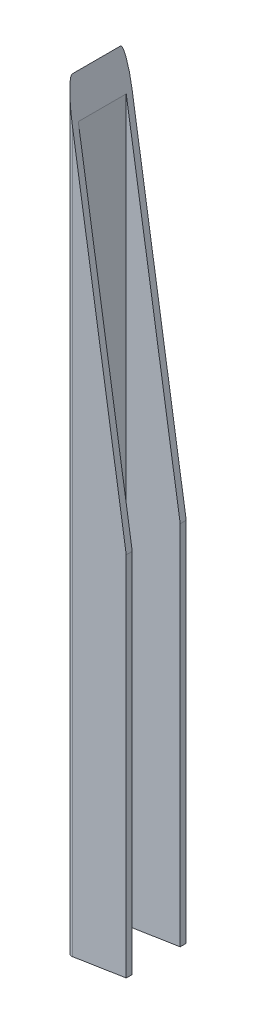
ISO-10303-21;
HEADER;
FILE_DESCRIPTION(('STEP AP214'),'2;1');
FILE_NAME('part.step','',(''),(''),'','','');
FILE_SCHEMA(('AUTOMOTIVE_DESIGN { 1 0 10303 214 1 1 1 1 }'));
ENDSEC;
DATA;
#1=APPLICATION_CONTEXT('core data for automotive mechanical design processes');
#2=APPLICATION_PROTOCOL_DEFINITION('international standard','automotive_design',2000,#1);
#3=PRODUCT_CONTEXT('',#1,'mechanical');
#4=PRODUCT('Part','Part','',(#3));
#5=PRODUCT_RELATED_PRODUCT_CATEGORY('part','',(#4));
#6=PRODUCT_DEFINITION_FORMATION('','',#4);
#7=PRODUCT_DEFINITION_CONTEXT('part definition',#1,'design');
#8=PRODUCT_DEFINITION('design','',#6,#7);
#9=PRODUCT_DEFINITION_SHAPE('','',#8);
#10=(LENGTH_UNIT() NAMED_UNIT(*) SI_UNIT(.MILLI.,.METRE.));
#11=(NAMED_UNIT(*) PLANE_ANGLE_UNIT() SI_UNIT($,.RADIAN.));
#12=(NAMED_UNIT(*) SI_UNIT($,.STERADIAN.) SOLID_ANGLE_UNIT());
#13=UNCERTAINTY_MEASURE_WITH_UNIT(LENGTH_MEASURE(1.E-05),#10,'distance_accuracy_value','');
#14=(GEOMETRIC_REPRESENTATION_CONTEXT(3) GLOBAL_UNCERTAINTY_ASSIGNED_CONTEXT((#13)) GLOBAL_UNIT_ASSIGNED_CONTEXT((#10,
#11,#12)) REPRESENTATION_CONTEXT('',''));
#15=CARTESIAN_POINT('',(0.,0.,0.));
#16=DIRECTION('',(0.,0.,1.));
#17=DIRECTION('',(1.,0.,0.));
#18=AXIS2_PLACEMENT_3D('',#15,#16,#17);
#19=CARTESIAN_POINT('',(-37.,380.,-12.));
#20=DIRECTION('',(0.,-1.,0.));
#21=DIRECTION('',(0.,0.,-1.));
#22=AXIS2_PLACEMENT_3D('',#19,#20,#21);
#23=CYLINDRICAL_SURFACE('',#22,3.);
#24=CARTESIAN_POINT('',(-37.,360.807534592797,-12.));
#25=DIRECTION('',(0.988002788154989,0.154436040476205,0.));
#26=DIRECTION('',(0.154436040476205,-0.988002788154989,0.));
#27=AXIS2_PLACEMENT_3D('',#24,#25,#26);
#28=ELLIPSE('',#27,19.4255174553133,3.);
#29=CARTESIAN_POINT('',(-37.,360.807534592797,-15.));
#30=VERTEX_POINT('',#29);
#31=CARTESIAN_POINT('',(-40.,380.,-12.));
#32=VERTEX_POINT('',#31);
#33=EDGE_CURVE('E179',#30,#32,#28,.T.);
#34=ORIENTED_EDGE('',*,*,#33,.F.);
#35=DIRECTION('',(0.,-1.,0.));
#36=VECTOR('',#35,1.);
#37=CARTESIAN_POINT('',(-37.,380.,-15.));
#38=LINE('',#37,#36);
#39=CARTESIAN_POINT('',(-37.,0.468934022234703,-15.));
#40=VERTEX_POINT('',#39);
#41=EDGE_CURVE('E167',#30,#40,#38,.T.);
#42=ORIENTED_EDGE('',*,*,#41,.T.);
#43=CARTESIAN_POINT('',(-37.,0.46893402223469,-12.));
#44=DIRECTION('',(0.154436040476207,-0.988002788154989,0.));
#45=DIRECTION('',(-0.988002788154989,-0.154436040476207,0.));
#46=AXIS2_PLACEMENT_3D('',#43,#44,#45);
#47=ELLIPSE('',#46,3.03642867810347,3.);
#48=CARTESIAN_POINT('',(-40.,0.,-12.));
#49=VERTEX_POINT('',#48);
#50=EDGE_CURVE('E236',#49,#40,#47,.T.);
#51=ORIENTED_EDGE('',*,*,#50,.F.);
#52=DIRECTION('',(0.,-1.,0.));
#53=VECTOR('',#52,1.);
#54=CARTESIAN_POINT('',(-40.,380.,-12.));
#55=LINE('',#54,#53);
#56=EDGE_CURVE('E200',#32,#49,#55,.T.);
#57=ORIENTED_EDGE('',*,*,#56,.F.);
#58=EDGE_LOOP('',(#34,#42,#51,#57));
#59=FACE_BOUND('',#58,.T.);
#60=ADVANCED_FACE('F73',(#59),#23,.T.);
#61=CARTESIAN_POINT('',(-37.,380.,12.));
#62=DIRECTION('',(0.,-1.,0.));
#63=DIRECTION('',(0.,0.,-1.));
#64=AXIS2_PLACEMENT_3D('',#61,#62,#63);
#65=CYLINDRICAL_SURFACE('',#64,3.);
#66=CARTESIAN_POINT('',(-37.,360.807534592797,12.));
#67=DIRECTION('',(0.988002788154989,0.154436040476205,0.));
#68=DIRECTION('',(0.154436040476205,-0.988002788154989,0.));
#69=AXIS2_PLACEMENT_3D('',#66,#67,#68);
#70=ELLIPSE('',#69,19.4255174553134,3.);
#71=CARTESIAN_POINT('',(-40.,380.,12.));
#72=VERTEX_POINT('',#71);
#73=CARTESIAN_POINT('',(-37.,360.807534592797,15.));
#74=VERTEX_POINT('',#73);
#75=EDGE_CURVE('E222',#72,#74,#70,.T.);
#76=ORIENTED_EDGE('',*,*,#75,.F.);
#77=DIRECTION('',(0.,-1.,0.));
#78=VECTOR('',#77,1.);
#79=CARTESIAN_POINT('',(-40.,380.,12.));
#80=LINE('',#79,#78);
#81=CARTESIAN_POINT('',(-40.,0.,12.));
#82=VERTEX_POINT('',#81);
#83=EDGE_CURVE('E197',#72,#82,#80,.T.);
#84=ORIENTED_EDGE('',*,*,#83,.T.);
#85=CARTESIAN_POINT('',(-37.,0.46893402223469,12.));
#86=DIRECTION('',(0.154436040476207,-0.988002788154989,0.));
#87=DIRECTION('',(-0.988002788154989,-0.154436040476207,0.));
#88=AXIS2_PLACEMENT_3D('',#85,#86,#87);
#89=ELLIPSE('',#88,3.03642867810348,3.);
#90=CARTESIAN_POINT('',(-37.,0.468934022234703,15.));
#91=VERTEX_POINT('',#90);
#92=EDGE_CURVE('E237',#91,#82,#89,.T.);
#93=ORIENTED_EDGE('',*,*,#92,.F.);
#94=DIRECTION('',(0.,-1.,0.));
#95=VECTOR('',#94,1.);
#96=CARTESIAN_POINT('',(-37.,380.,15.));
#97=LINE('',#96,#95);
#98=EDGE_CURVE('E194',#74,#91,#97,.T.);
#99=ORIENTED_EDGE('',*,*,#98,.F.);
#100=EDGE_LOOP('',(#76,#84,#93,#99));
#101=FACE_BOUND('',#100,.T.);
#102=ADVANCED_FACE('F263',(#101),#65,.T.);
#103=CARTESIAN_POINT('',(-37.,380.,15.));
#104=DIRECTION('',(0.,0.,-1.));
#105=DIRECTION('',(-1.,0.,0.));
#106=AXIS2_PLACEMENT_3D('',#103,#104,#105);
#107=PLANE('',#106);
#108=DIRECTION('',(-0.154436040476205,0.988002788154989,0.));
#109=VECTOR('',#108,1.);
#110=CARTESIAN_POINT('',(-40.,380.,15.));
#111=LINE('',#110,#109);
#112=CARTESIAN_POINT('',(-10.,188.07534592797,15.));
#113=VERTEX_POINT('',#112);
#114=EDGE_CURVE('E86',#113,#74,#111,.T.);
#115=ORIENTED_EDGE('',*,*,#114,.T.);
#116=ORIENTED_EDGE('',*,*,#98,.T.);
#117=DIRECTION('',(0.988002788154989,0.154436040476207,0.));
#118=VECTOR('',#117,1.);
#119=CARTESIAN_POINT('',(-10.,4.68934022234704,15.));
#120=LINE('',#119,#118);
#121=CARTESIAN_POINT('',(-10.,4.68934022234704,15.));
#122=VERTEX_POINT('',#121);
#123=EDGE_CURVE('E206',#91,#122,#120,.T.);
#124=ORIENTED_EDGE('',*,*,#123,.T.);
#125=DIRECTION('',(0.,1.,0.));
#126=VECTOR('',#125,1.);
#127=CARTESIAN_POINT('',(-10.,380.,15.));
#128=LINE('',#127,#126);
#129=EDGE_CURVE('E172',#122,#113,#128,.T.);
#130=ORIENTED_EDGE('',*,*,#129,.T.);
#131=EDGE_LOOP('',(#115,#116,#124,#130));
#132=FACE_BOUND('',#131,.T.);
#133=ADVANCED_FACE('F212',(#132),#107,.F.);
#134=CARTESIAN_POINT('',(-37.,380.,-15.));
#135=DIRECTION('',(0.,0.,1.));
#136=DIRECTION('',(1.,0.,0.));
#137=AXIS2_PLACEMENT_3D('',#134,#135,#136);
#138=PLANE('',#137);
#139=DIRECTION('',(-0.154436040476205,0.988002788154989,0.));
#140=VECTOR('',#139,1.);
#141=CARTESIAN_POINT('',(-40.,380.,-15.));
#142=LINE('',#141,#140);
#143=CARTESIAN_POINT('',(-10.,188.07534592797,-15.));
#144=VERTEX_POINT('',#143);
#145=EDGE_CURVE('E149',#144,#30,#142,.T.);
#146=ORIENTED_EDGE('',*,*,#145,.F.);
#147=DIRECTION('',(0.,-1.,0.));
#148=VECTOR('',#147,1.);
#149=CARTESIAN_POINT('',(-10.,380.,-15.));
#150=LINE('',#149,#148);
#151=CARTESIAN_POINT('',(-10.,4.68934022234706,-15.));
#152=VERTEX_POINT('',#151);
#153=EDGE_CURVE('E165',#144,#152,#150,.T.);
#154=ORIENTED_EDGE('',*,*,#153,.T.);
#155=DIRECTION('',(0.988002788154989,0.154436040476207,0.));
#156=VECTOR('',#155,1.);
#157=CARTESIAN_POINT('',(-10.,4.68934022234704,-15.));
#158=LINE('',#157,#156);
#159=EDGE_CURVE('E168',#40,#152,#158,.T.);
#160=ORIENTED_EDGE('',*,*,#159,.F.);
#161=ORIENTED_EDGE('',*,*,#41,.F.);
#162=EDGE_LOOP('',(#146,#154,#160,#161));
#163=FACE_BOUND('',#162,.T.);
#164=ADVANCED_FACE('F163',(#163),#138,.F.);
#165=CARTESIAN_POINT('',(-37.,380.,-12.));
#166=DIRECTION('',(1.,0.,0.));
#167=DIRECTION('',(0.,0.,-1.));
#168=AXIS2_PLACEMENT_3D('',#165,#166,#167);
#169=PLANE('',#168);
#170=DIRECTION('',(0.,-1.,0.));
#171=VECTOR('',#170,1.);
#172=CARTESIAN_POINT('',(-37.,380.,-12.));
#173=LINE('',#172,#171);
#174=CARTESIAN_POINT('',(-37.,360.807534592797,-12.));
#175=VERTEX_POINT('',#174);
#176=CARTESIAN_POINT('',(-37.,0.468934022234684,-12.));
#177=VERTEX_POINT('',#176);
#178=EDGE_CURVE('E176',#175,#177,#173,.T.);
#179=ORIENTED_EDGE('',*,*,#178,.F.);
#180=DIRECTION('',(0.,0.,1.));
#181=VECTOR('',#180,1.);
#182=CARTESIAN_POINT('',(-37.,360.807534592797,-12.));
#183=LINE('',#182,#181);
#184=CARTESIAN_POINT('',(-37.,360.807534592797,12.));
#185=VERTEX_POINT('',#184);
#186=EDGE_CURVE('E223',#175,#185,#183,.T.);
#187=ORIENTED_EDGE('',*,*,#186,.T.);
#188=DIRECTION('',(0.,-1.,0.));
#189=VECTOR('',#188,1.);
#190=CARTESIAN_POINT('',(-37.,380.,12.));
#191=LINE('',#190,#189);
#192=CARTESIAN_POINT('',(-37.,0.468934022234689,12.));
#193=VERTEX_POINT('',#192);
#194=EDGE_CURVE('E185',#185,#193,#191,.T.);
#195=ORIENTED_EDGE('',*,*,#194,.T.);
#196=DIRECTION('',(0.,0.,-1.));
#197=VECTOR('',#196,1.);
#198=CARTESIAN_POINT('',(-37.,0.46893402223469,-12.));
#199=LINE('',#198,#197);
#200=EDGE_CURVE('E242',#193,#177,#199,.T.);
#201=ORIENTED_EDGE('',*,*,#200,.T.);
#202=EDGE_LOOP('',(#179,#187,#195,#201));
#203=FACE_BOUND('',#202,.T.);
#204=ADVANCED_FACE('F253',(#203),#169,.T.);
#205=CARTESIAN_POINT('',(-37.,380.,12.));
#206=DIRECTION('',(0.,0.,-1.));
#207=DIRECTION('',(-1.,0.,0.));
#208=AXIS2_PLACEMENT_3D('',#205,#206,#207);
#209=PLANE('',#208);
#210=ORIENTED_EDGE('',*,*,#194,.F.);
#211=DIRECTION('',(0.154436040476205,-0.988002788154989,0.));
#212=VECTOR('',#211,1.);
#213=CARTESIAN_POINT('',(-39.9284485282061,379.542250284254,12.));
#214=LINE('',#213,#212);
#215=CARTESIAN_POINT('',(-10.,188.07534592797,12.));
#216=VERTEX_POINT('',#215);
#217=EDGE_CURVE('E217',#185,#216,#214,.T.);
#218=ORIENTED_EDGE('',*,*,#217,.T.);
#219=DIRECTION('',(0.,1.,0.));
#220=VECTOR('',#219,1.);
#221=CARTESIAN_POINT('',(-10.,380.,12.));
#222=LINE('',#221,#220);
#223=CARTESIAN_POINT('',(-10.,4.68934022234702,12.));
#224=VERTEX_POINT('',#223);
#225=EDGE_CURVE('E173',#224,#216,#222,.T.);
#226=ORIENTED_EDGE('',*,*,#225,.F.);
#227=DIRECTION('',(-0.988002788154989,-0.154436040476207,0.));
#228=VECTOR('',#227,1.);
#229=CARTESIAN_POINT('',(20.9100791894076,9.52093614297439,12.));
#230=LINE('',#229,#228);
#231=EDGE_CURVE('E94',#224,#193,#230,.T.);
#232=ORIENTED_EDGE('',*,*,#231,.T.);
#233=EDGE_LOOP('',(#210,#218,#226,#232));
#234=FACE_BOUND('',#233,.T.);
#235=ADVANCED_FACE('F221',(#234),#209,.T.);
#236=CARTESIAN_POINT('',(-37.,380.,-12.));
#237=DIRECTION('',(0.,0.,1.));
#238=DIRECTION('',(1.,0.,0.));
#239=AXIS2_PLACEMENT_3D('',#236,#237,#238);
#240=PLANE('',#239);
#241=DIRECTION('',(0.,-1.,0.));
#242=VECTOR('',#241,1.);
#243=CARTESIAN_POINT('',(-10.,380.,-12.));
#244=LINE('',#243,#242);
#245=CARTESIAN_POINT('',(-10.,188.07534592797,-12.));
#246=VERTEX_POINT('',#245);
#247=CARTESIAN_POINT('',(-10.,4.68934022234704,-12.));
#248=VERTEX_POINT('',#247);
#249=EDGE_CURVE('E203',#246,#248,#244,.T.);
#250=ORIENTED_EDGE('',*,*,#249,.F.);
#251=DIRECTION('',(-0.154436040476205,0.988002788154989,0.));
#252=VECTOR('',#251,1.);
#253=CARTESIAN_POINT('',(-39.9284485282061,379.542250284254,-12.));
#254=LINE('',#253,#252);
#255=EDGE_CURVE('E152',#246,#175,#254,.T.);
#256=ORIENTED_EDGE('',*,*,#255,.T.);
#257=ORIENTED_EDGE('',*,*,#178,.T.);
#258=DIRECTION('',(0.988002788154989,0.154436040476207,0.));
#259=VECTOR('',#258,1.);
#260=CARTESIAN_POINT('',(20.9100791894076,9.52093614297439,-12.));
#261=LINE('',#260,#259);
#262=EDGE_CURVE('E157',#177,#248,#261,.T.);
#263=ORIENTED_EDGE('',*,*,#262,.T.);
#264=EDGE_LOOP('',(#250,#256,#257,#263));
#265=FACE_BOUND('',#264,.T.);
#266=ADVANCED_FACE('F250',(#265),#240,.T.);
#267=CARTESIAN_POINT('',(-10.,0.,21.925100868927));
#268=DIRECTION('',(-1.,0.,0.));
#269=DIRECTION('',(0.,0.,1.));
#270=AXIS2_PLACEMENT_3D('',#267,#268,#269);
#271=PLANE('',#270);
#272=DIRECTION('',(0.,0.,1.));
#273=VECTOR('',#272,1.);
#274=CARTESIAN_POINT('',(-10.,188.07534592797,-15.));
#275=LINE('',#274,#273);
#276=EDGE_CURVE('E146',#144,#246,#275,.T.);
#277=ORIENTED_EDGE('',*,*,#276,.T.);
#278=ORIENTED_EDGE('',*,*,#249,.T.);
#279=DIRECTION('',(0.,0.,1.));
#280=VECTOR('',#279,1.);
#281=CARTESIAN_POINT('',(-10.,4.68934022234704,-15.));
#282=LINE('',#281,#280);
#283=EDGE_CURVE('E158',#152,#248,#282,.T.);
#284=ORIENTED_EDGE('',*,*,#283,.F.);
#285=ORIENTED_EDGE('',*,*,#153,.F.);
#286=EDGE_LOOP('',(#277,#278,#284,#285));
#287=FACE_BOUND('',#286,.T.);
#288=ADVANCED_FACE('F171',(#287),#271,.F.);
#289=DIRECTION('',(0.,0.,-1.));
#290=VECTOR('',#289,1.);
#291=CARTESIAN_POINT('',(-10.,188.07534592797,21.925100868927));
#292=LINE('',#291,#290);
#293=EDGE_CURVE('E13',#113,#216,#292,.T.);
#294=ORIENTED_EDGE('',*,*,#293,.F.);
#295=ORIENTED_EDGE('',*,*,#129,.F.);
#296=DIRECTION('',(0.,0.,1.));
#297=VECTOR('',#296,1.);
#298=CARTESIAN_POINT('',(-10.,4.68934022234704,21.925100868927));
#299=LINE('',#298,#297);
#300=EDGE_CURVE('E80',#224,#122,#299,.T.);
#301=ORIENTED_EDGE('',*,*,#300,.F.);
#302=ORIENTED_EDGE('',*,*,#225,.T.);
#303=EDGE_LOOP('',(#294,#295,#301,#302));
#304=FACE_BOUND('',#303,.T.);
#305=ADVANCED_FACE('F215',(#304),#271,.F.);
#306=CARTESIAN_POINT('',(-40.,380.,-12.));
#307=DIRECTION('',(1.,0.,0.));
#308=DIRECTION('',(0.,0.,-1.));
#309=AXIS2_PLACEMENT_3D('',#306,#307,#308);
#310=PLANE('',#309);
#311=DIRECTION('',(0.,0.,1.));
#312=VECTOR('',#311,1.);
#313=CARTESIAN_POINT('',(-40.,0.,-12.));
#314=LINE('',#313,#312);
#315=EDGE_CURVE('E188',#49,#82,#314,.T.);
#316=ORIENTED_EDGE('',*,*,#315,.T.);
#317=ORIENTED_EDGE('',*,*,#83,.F.);
#318=DIRECTION('',(0.,0.,1.));
#319=VECTOR('',#318,1.);
#320=CARTESIAN_POINT('',(-40.,380.,-12.));
#321=LINE('',#320,#319);
#322=EDGE_CURVE('E189',#32,#72,#321,.T.);
#323=ORIENTED_EDGE('',*,*,#322,.F.);
#324=ORIENTED_EDGE('',*,*,#56,.T.);
#325=EDGE_LOOP('',(#316,#317,#323,#324));
#326=FACE_BOUND('',#325,.T.);
#327=ADVANCED_FACE('F234',(#326),#310,.F.);
#328=CARTESIAN_POINT('',(-10.,4.68934022234704,-15.));
#329=DIRECTION('',(0.154436040476207,-0.988002788154989,0.));
#330=DIRECTION('',(0.988002788154989,0.154436040476207,0.));
#331=AXIS2_PLACEMENT_3D('',#328,#329,#330);
#332=PLANE('',#331);
#333=ORIENTED_EDGE('',*,*,#50,.T.);
#334=ORIENTED_EDGE('',*,*,#159,.T.);
#335=ORIENTED_EDGE('',*,*,#283,.T.);
#336=ORIENTED_EDGE('',*,*,#262,.F.);
#337=ORIENTED_EDGE('',*,*,#200,.F.);
#338=ORIENTED_EDGE('',*,*,#231,.F.);
#339=ORIENTED_EDGE('',*,*,#300,.T.);
#340=ORIENTED_EDGE('',*,*,#123,.F.);
#341=ORIENTED_EDGE('',*,*,#92,.T.);
#342=ORIENTED_EDGE('',*,*,#315,.F.);
#343=EDGE_LOOP('',(#333,#334,#335,#336,#337,#338,#339,#340,#341,#342));
#344=FACE_BOUND('',#343,.T.);
#345=ADVANCED_FACE('F205',(#344),#332,.T.);
#346=CARTESIAN_POINT('',(-40.,380.,-15.));
#347=DIRECTION('',(0.988002788154989,0.154436040476205,0.));
#348=DIRECTION('',(-0.154436040476205,0.988002788154989,0.));
#349=AXIS2_PLACEMENT_3D('',#346,#347,#348);
#350=PLANE('',#349);
#351=ORIENTED_EDGE('',*,*,#33,.T.);
#352=ORIENTED_EDGE('',*,*,#322,.T.);
#353=ORIENTED_EDGE('',*,*,#75,.T.);
#354=ORIENTED_EDGE('',*,*,#114,.F.);
#355=ORIENTED_EDGE('',*,*,#293,.T.);
#356=ORIENTED_EDGE('',*,*,#217,.F.);
#357=ORIENTED_EDGE('',*,*,#186,.F.);
#358=ORIENTED_EDGE('',*,*,#255,.F.);
#359=ORIENTED_EDGE('',*,*,#276,.F.);
#360=ORIENTED_EDGE('',*,*,#145,.T.);
#361=EDGE_LOOP('',(#351,#352,#353,#354,#355,#356,#357,#358,#359,#360));
#362=FACE_BOUND('',#361,.T.);
#363=ADVANCED_FACE('F148',(#362),#350,.T.);
#364=CLOSED_SHELL('',(#60,#102,#133,#164,#204,#235,#266,#288,#305,#327,#345,#363));
#365=MANIFOLD_SOLID_BREP('B2',#364);
#366=ADVANCED_BREP_SHAPE_REPRESENTATION('',(#18,#365),#14);
#367=SHAPE_DEFINITION_REPRESENTATION(#9,#366);
ENDSEC;
END-ISO-10303-21;
